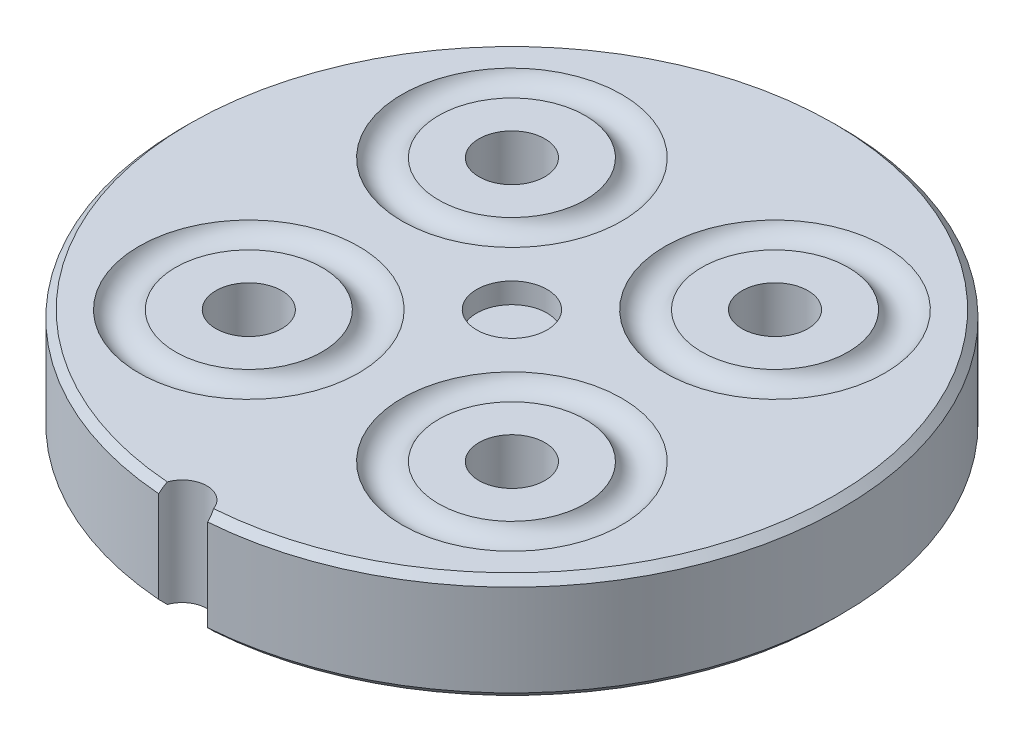
ISO-10303-21;
HEADER;
FILE_DESCRIPTION(('STEP AP214'),'2;1');
FILE_NAME('part.step','',(''),(''),'','','');
FILE_SCHEMA(('AUTOMOTIVE_DESIGN { 1 0 10303 214 1 1 1 1 }'));
ENDSEC;
DATA;
#1=APPLICATION_CONTEXT('core data for automotive mechanical design processes');
#2=APPLICATION_PROTOCOL_DEFINITION('international standard','automotive_design',2000,#1);
#3=PRODUCT_CONTEXT('',#1,'mechanical');
#4=PRODUCT('Part','Part','',(#3));
#5=PRODUCT_RELATED_PRODUCT_CATEGORY('part','',(#4));
#6=PRODUCT_DEFINITION_FORMATION('','',#4);
#7=PRODUCT_DEFINITION_CONTEXT('part definition',#1,'design');
#8=PRODUCT_DEFINITION('design','',#6,#7);
#9=PRODUCT_DEFINITION_SHAPE('','',#8);
#10=(LENGTH_UNIT() NAMED_UNIT(*) SI_UNIT(.MILLI.,.METRE.));
#11=(NAMED_UNIT(*) PLANE_ANGLE_UNIT() SI_UNIT($,.RADIAN.));
#12=(NAMED_UNIT(*) SI_UNIT($,.STERADIAN.) SOLID_ANGLE_UNIT());
#13=UNCERTAINTY_MEASURE_WITH_UNIT(LENGTH_MEASURE(1.E-05),#10,'distance_accuracy_value','');
#14=(GEOMETRIC_REPRESENTATION_CONTEXT(3) GLOBAL_UNCERTAINTY_ASSIGNED_CONTEXT((#13)) GLOBAL_UNIT_ASSIGNED_CONTEXT((#10,
#11,#12)) REPRESENTATION_CONTEXT('',''));
#15=CARTESIAN_POINT('',(0.,0.,0.));
#16=DIRECTION('',(0.,0.,1.));
#17=DIRECTION('',(1.,0.,0.));
#18=AXIS2_PLACEMENT_3D('',#15,#16,#17);
#19=CARTESIAN_POINT('',(0.,0.,11.25));
#20=DIRECTION('',(0.,1.,0.));
#21=DIRECTION('',(0.,0.,1.));
#22=AXIS2_PLACEMENT_3D('',#19,#20,#21);
#23=PLANE('',#22);
#24=CARTESIAN_POINT('',(8.98025612106904,0.,8.98025612106927));
#25=DIRECTION('',(0.,1.,0.));
#26=DIRECTION('',(0.,0.,1.));
#27=AXIS2_PLACEMENT_3D('',#24,#25,#26);
#28=CIRCLE('',#27,7.5);
#29=CARTESIAN_POINT('',(8.98025612106899,0.,16.4802561210693));
#30=VERTEX_POINT('',#29);
#31=EDGE_CURVE('E455',#30,#30,#28,.T.);
#32=ORIENTED_EDGE('',*,*,#31,.T.);
#33=EDGE_LOOP('',(#32));
#34=FACE_BOUND('',#33,.T.);
#35=CARTESIAN_POINT('',(-8.98025612106908,0.,-8.98025612106922));
#36=DIRECTION('',(0.,1.,0.));
#37=DIRECTION('',(0.,0.,-1.));
#38=AXIS2_PLACEMENT_3D('',#35,#36,#37);
#39=CIRCLE('',#38,7.5);
#40=CARTESIAN_POINT('',(-8.98025612106907,0.,-16.4802561210692));
#41=VERTEX_POINT('',#40);
#42=EDGE_CURVE('E223',#41,#41,#39,.T.);
#43=ORIENTED_EDGE('',*,*,#42,.T.);
#44=EDGE_LOOP('',(#43));
#45=FACE_BOUND('',#44,.T.);
#46=CARTESIAN_POINT('',(0.,0.,22.5));
#47=DIRECTION('',(0.,-1.,0.));
#48=DIRECTION('',(0.,0.,1.));
#49=AXIS2_PLACEMENT_3D('',#46,#47,#48);
#50=CIRCLE('',#49,1.67499999999997);
#51=CARTESIAN_POINT('',(-1.57974935984492,0.,21.9432083333333));
#52=VERTEX_POINT('',#51);
#53=CARTESIAN_POINT('',(1.57974935984492,0.,21.9432083333333));
#54=VERTEX_POINT('',#53);
#55=EDGE_CURVE('E124',#52,#54,#50,.T.);
#56=ORIENTED_EDGE('',*,*,#55,.F.);
#57=CARTESIAN_POINT('',(0.,0.,0.));
#58=DIRECTION('',(0.,1.,0.));
#59=DIRECTION('',(0.,0.,1.));
#60=AXIS2_PLACEMENT_3D('',#57,#58,#59);
#61=CIRCLE('',#60,22.);
#62=EDGE_CURVE('E41',#52,#54,#61,.F.);
#63=ORIENTED_EDGE('',*,*,#62,.T.);
#64=EDGE_LOOP('',(#56,#63));
#65=FACE_BOUND('',#64,.T.);
#66=CARTESIAN_POINT('',(-8.9802561210692,0.,8.98025612106911));
#67=DIRECTION('',(0.,1.,0.));
#68=DIRECTION('',(-1.,0.,0.));
#69=AXIS2_PLACEMENT_3D('',#66,#67,#68);
#70=CIRCLE('',#69,7.5);
#71=CARTESIAN_POINT('',(-16.4802561210692,0.,8.98025612106911));
#72=VERTEX_POINT('',#71);
#73=EDGE_CURVE('E235',#72,#72,#70,.T.);
#74=ORIENTED_EDGE('',*,*,#73,.T.);
#75=EDGE_LOOP('',(#74));
#76=FACE_BOUND('',#75,.T.);
#77=CARTESIAN_POINT('',(8.98025612106925,0.,-8.98025612106906));
#78=DIRECTION('',(0.,1.,0.));
#79=DIRECTION('',(1.,0.,0.));
#80=AXIS2_PLACEMENT_3D('',#77,#78,#79);
#81=CIRCLE('',#80,7.5);
#82=CARTESIAN_POINT('',(16.4802561210692,0.,-8.98025612106903));
#83=VERTEX_POINT('',#82);
#84=EDGE_CURVE('E212',#83,#83,#81,.T.);
#85=ORIENTED_EDGE('',*,*,#84,.T.);
#86=EDGE_LOOP('',(#85));
#87=FACE_BOUND('',#86,.T.);
#88=ADVANCED_FACE('F32',(#34,#45,#65,#76,#87),#23,.F.);
#89=CARTESIAN_POINT('',(0.,7.25,11.25));
#90=DIRECTION('',(0.,1.,0.));
#91=DIRECTION('',(0.,0.,1.));
#92=AXIS2_PLACEMENT_3D('',#89,#90,#91);
#93=PLANE('',#92);
#94=CARTESIAN_POINT('',(0.,7.25,0.));
#95=DIRECTION('',(0.,1.,0.));
#96=DIRECTION('',(0.,0.,1.));
#97=AXIS2_PLACEMENT_3D('',#94,#95,#96);
#98=CIRCLE('',#97,2.4);
#99=CARTESIAN_POINT('',(0.,7.25,2.4));
#100=VERTEX_POINT('',#99);
#101=EDGE_CURVE('E452',#100,#100,#98,.T.);
#102=ORIENTED_EDGE('',*,*,#101,.F.);
#103=EDGE_LOOP('',(#102));
#104=FACE_BOUND('',#103,.T.);
#105=CARTESIAN_POINT('',(8.98025612106904,7.25,8.98025612106926));
#106=DIRECTION('',(0.,1.,0.));
#107=DIRECTION('',(0.,0.,1.));
#108=AXIS2_PLACEMENT_3D('',#105,#106,#107);
#109=CIRCLE('',#108,7.5);
#110=CARTESIAN_POINT('',(8.98025612106899,7.25,16.4802561210693));
#111=VERTEX_POINT('',#110);
#112=EDGE_CURVE('E461',#111,#111,#109,.T.);
#113=ORIENTED_EDGE('',*,*,#112,.F.);
#114=EDGE_LOOP('',(#113));
#115=FACE_BOUND('',#114,.T.);
#116=CARTESIAN_POINT('',(-8.98025612106908,7.25,-8.98025612106922));
#117=DIRECTION('',(0.,1.,0.));
#118=DIRECTION('',(0.,0.,-1.));
#119=AXIS2_PLACEMENT_3D('',#116,#117,#118);
#120=CIRCLE('',#119,7.5);
#121=CARTESIAN_POINT('',(-8.98025612106907,7.25,-16.4802561210692));
#122=VERTEX_POINT('',#121);
#123=EDGE_CURVE('E226',#122,#122,#120,.T.);
#124=ORIENTED_EDGE('',*,*,#123,.F.);
#125=EDGE_LOOP('',(#124));
#126=FACE_BOUND('',#125,.T.);
#127=CARTESIAN_POINT('',(0.,7.25,22.5));
#128=DIRECTION('',(0.,-1.,0.));
#129=DIRECTION('',(0.,0.,1.));
#130=AXIS2_PLACEMENT_3D('',#127,#128,#129);
#131=CIRCLE('',#130,1.67499999999997);
#132=CARTESIAN_POINT('',(-1.57974935984494,7.25,21.9432083333334));
#133=VERTEX_POINT('',#132);
#134=CARTESIAN_POINT('',(1.57974935984494,7.25,21.9432083333334));
#135=VERTEX_POINT('',#134);
#136=EDGE_CURVE('E77',#133,#135,#131,.T.);
#137=ORIENTED_EDGE('',*,*,#136,.T.);
#138=CARTESIAN_POINT('',(0.,7.25,0.));
#139=DIRECTION('',(0.,1.,0.));
#140=DIRECTION('',(0.,0.,1.));
#141=AXIS2_PLACEMENT_3D('',#138,#139,#140);
#142=CIRCLE('',#141,22.);
#143=EDGE_CURVE('E11',#135,#133,#142,.T.);
#144=ORIENTED_EDGE('',*,*,#143,.T.);
#145=EDGE_LOOP('',(#137,#144));
#146=FACE_BOUND('',#145,.T.);
#147=CARTESIAN_POINT('',(-8.9802561210692,7.25,8.98025612106911));
#148=DIRECTION('',(0.,1.,0.));
#149=DIRECTION('',(-1.,0.,0.));
#150=AXIS2_PLACEMENT_3D('',#147,#148,#149);
#151=CIRCLE('',#150,7.5);
#152=CARTESIAN_POINT('',(-16.4802561210692,7.25,8.98025612106911));
#153=VERTEX_POINT('',#152);
#154=EDGE_CURVE('E206',#153,#153,#151,.T.);
#155=ORIENTED_EDGE('',*,*,#154,.F.);
#156=EDGE_LOOP('',(#155));
#157=FACE_BOUND('',#156,.T.);
#158=CARTESIAN_POINT('',(8.98025612106924,7.25,-8.98025612106906));
#159=DIRECTION('',(0.,1.,0.));
#160=DIRECTION('',(1.,0.,0.));
#161=AXIS2_PLACEMENT_3D('',#158,#159,#160);
#162=CIRCLE('',#161,7.5);
#163=CARTESIAN_POINT('',(16.4802561210692,7.25,-8.98025612106903));
#164=VERTEX_POINT('',#163);
#165=EDGE_CURVE('E209',#164,#164,#162,.T.);
#166=ORIENTED_EDGE('',*,*,#165,.F.);
#167=EDGE_LOOP('',(#166));
#168=FACE_BOUND('',#167,.T.);
#169=ADVANCED_FACE('F136',(#104,#115,#126,#146,#157,#168),#93,.T.);
#170=CARTESIAN_POINT('',(8.98025612106904,0.,8.98025612106927));
#171=DIRECTION('',(0.,1.,0.));
#172=DIRECTION('',(0.,0.,1.));
#173=AXIS2_PLACEMENT_3D('',#170,#171,#172);
#174=CIRCLE('',#173,4.99242800861692);
#175=CARTESIAN_POINT('',(8.98025612106901,0.,13.9726841296862));
#176=VERTEX_POINT('',#175);
#177=EDGE_CURVE('E451',#176,#176,#174,.T.);
#178=ORIENTED_EDGE('',*,*,#177,.F.);
#179=EDGE_LOOP('',(#178));
#180=FACE_BOUND('',#179,.T.);
#181=CARTESIAN_POINT('',(8.98025612106914,0.,8.98025612106917));
#182=DIRECTION('',(0.,1.,0.));
#183=DIRECTION('',(0.,0.,1.));
#184=AXIS2_PLACEMENT_3D('',#181,#182,#183);
#185=CIRCLE('',#184,2.25);
#186=CARTESIAN_POINT('',(8.98025612106914,0.,11.2302561210692));
#187=VERTEX_POINT('',#186);
#188=EDGE_CURVE('E193',#187,#187,#185,.T.);
#189=ORIENTED_EDGE('',*,*,#188,.T.);
#190=EDGE_LOOP('',(#189));
#191=FACE_BOUND('',#190,.T.);
#192=ADVANCED_FACE('F138',(#180,#191),#23,.F.);
#193=CARTESIAN_POINT('',(8.98025612106904,7.25,8.98025612106926));
#194=DIRECTION('',(0.,1.,0.));
#195=DIRECTION('',(0.,0.,1.));
#196=AXIS2_PLACEMENT_3D('',#193,#194,#195);
#197=CIRCLE('',#196,5.);
#198=CARTESIAN_POINT('',(8.98025612106901,7.25,13.9802561210693));
#199=VERTEX_POINT('',#198);
#200=EDGE_CURVE('E464',#199,#199,#197,.T.);
#201=ORIENTED_EDGE('',*,*,#200,.T.);
#202=EDGE_LOOP('',(#201));
#203=FACE_BOUND('',#202,.T.);
#204=CARTESIAN_POINT('',(8.98025612106914,7.25,8.98025612106917));
#205=DIRECTION('',(0.,1.,0.));
#206=DIRECTION('',(0.,0.,1.));
#207=AXIS2_PLACEMENT_3D('',#204,#205,#206);
#208=CIRCLE('',#207,2.25);
#209=CARTESIAN_POINT('',(8.98025612106914,7.25,11.2302561210692));
#210=VERTEX_POINT('',#209);
#211=EDGE_CURVE('E187',#210,#210,#208,.F.);
#212=ORIENTED_EDGE('',*,*,#211,.T.);
#213=EDGE_LOOP('',(#212));
#214=FACE_BOUND('',#213,.T.);
#215=ADVANCED_FACE('F144',(#203,#214),#93,.T.);
#216=CARTESIAN_POINT('',(8.98025612106925,0.,-8.98025612106906));
#217=DIRECTION('',(0.,1.,0.));
#218=DIRECTION('',(1.,0.,0.));
#219=AXIS2_PLACEMENT_3D('',#216,#217,#218);
#220=CIRCLE('',#219,4.99242800861692);
#221=CARTESIAN_POINT('',(13.9726841296862,0.,-8.98025612106904));
#222=VERTEX_POINT('',#221);
#223=EDGE_CURVE('E181',#222,#222,#220,.T.);
#224=ORIENTED_EDGE('',*,*,#223,.F.);
#225=EDGE_LOOP('',(#224));
#226=FACE_BOUND('',#225,.T.);
#227=CARTESIAN_POINT('',(8.9802561210692,0.,-8.98025612106911));
#228=DIRECTION('',(0.,1.,0.));
#229=DIRECTION('',(0.,0.,1.));
#230=AXIS2_PLACEMENT_3D('',#227,#228,#229);
#231=CIRCLE('',#230,2.25);
#232=CARTESIAN_POINT('',(8.9802561210692,0.,-6.7302561210691));
#233=VERTEX_POINT('',#232);
#234=EDGE_CURVE('E184',#233,#233,#231,.T.);
#235=ORIENTED_EDGE('',*,*,#234,.T.);
#236=EDGE_LOOP('',(#235));
#237=FACE_BOUND('',#236,.T.);
#238=ADVANCED_FACE('F150',(#226,#237),#23,.F.);
#239=CARTESIAN_POINT('',(8.98025612106924,7.25,-8.98025612106906));
#240=DIRECTION('',(0.,1.,0.));
#241=DIRECTION('',(1.,0.,0.));
#242=AXIS2_PLACEMENT_3D('',#239,#240,#241);
#243=CIRCLE('',#242,5.);
#244=CARTESIAN_POINT('',(13.9802561210692,7.25,-8.98025612106904));
#245=VERTEX_POINT('',#244);
#246=EDGE_CURVE('E211',#245,#245,#243,.T.);
#247=ORIENTED_EDGE('',*,*,#246,.T.);
#248=EDGE_LOOP('',(#247));
#249=FACE_BOUND('',#248,.T.);
#250=CARTESIAN_POINT('',(8.9802561210692,7.25,-8.98025612106911));
#251=DIRECTION('',(0.,1.,0.));
#252=DIRECTION('',(0.,0.,1.));
#253=AXIS2_PLACEMENT_3D('',#250,#251,#252);
#254=CIRCLE('',#253,2.25);
#255=CARTESIAN_POINT('',(8.9802561210692,7.25,-6.7302561210691));
#256=VERTEX_POINT('',#255);
#257=EDGE_CURVE('E186',#256,#256,#254,.F.);
#258=ORIENTED_EDGE('',*,*,#257,.T.);
#259=EDGE_LOOP('',(#258));
#260=FACE_BOUND('',#259,.T.);
#261=ADVANCED_FACE('F162',(#249,#260),#93,.T.);
#262=CARTESIAN_POINT('',(-8.98025612106908,0.,-8.98025612106922));
#263=DIRECTION('',(0.,1.,0.));
#264=DIRECTION('',(0.,0.,-1.));
#265=AXIS2_PLACEMENT_3D('',#262,#263,#264);
#266=CIRCLE('',#265,4.99242800861692);
#267=CARTESIAN_POINT('',(-8.98025612106907,0.,-13.9726841296861));
#268=VERTEX_POINT('',#267);
#269=EDGE_CURVE('E215',#268,#268,#266,.T.);
#270=ORIENTED_EDGE('',*,*,#269,.F.);
#271=EDGE_LOOP('',(#270));
#272=FACE_BOUND('',#271,.T.);
#273=CARTESIAN_POINT('',(-8.98025612106914,0.,-8.98025612106917));
#274=DIRECTION('',(0.,1.,0.));
#275=DIRECTION('',(0.,0.,1.));
#276=AXIS2_PLACEMENT_3D('',#273,#274,#275);
#277=CIRCLE('',#276,2.25);
#278=CARTESIAN_POINT('',(-8.98025612106914,0.,-6.73025612106917));
#279=VERTEX_POINT('',#278);
#280=EDGE_CURVE('E190',#279,#279,#277,.T.);
#281=ORIENTED_EDGE('',*,*,#280,.T.);
#282=EDGE_LOOP('',(#281));
#283=FACE_BOUND('',#282,.T.);
#284=ADVANCED_FACE('F153',(#272,#283),#23,.F.);
#285=CARTESIAN_POINT('',(-8.98025612106908,7.25,-8.98025612106922));
#286=DIRECTION('',(0.,1.,0.));
#287=DIRECTION('',(0.,0.,-1.));
#288=AXIS2_PLACEMENT_3D('',#285,#286,#287);
#289=CIRCLE('',#288,5.);
#290=CARTESIAN_POINT('',(-8.98025612106907,7.25,-13.9802561210692));
#291=VERTEX_POINT('',#290);
#292=EDGE_CURVE('E229',#291,#291,#289,.T.);
#293=ORIENTED_EDGE('',*,*,#292,.T.);
#294=EDGE_LOOP('',(#293));
#295=FACE_BOUND('',#294,.T.);
#296=CARTESIAN_POINT('',(-8.98025612106914,7.25,-8.98025612106917));
#297=DIRECTION('',(0.,1.,0.));
#298=DIRECTION('',(0.,0.,1.));
#299=AXIS2_PLACEMENT_3D('',#296,#297,#298);
#300=CIRCLE('',#299,2.25);
#301=CARTESIAN_POINT('',(-8.98025612106914,7.25,-6.73025612106917));
#302=VERTEX_POINT('',#301);
#303=EDGE_CURVE('E127',#302,#302,#300,.F.);
#304=ORIENTED_EDGE('',*,*,#303,.T.);
#305=EDGE_LOOP('',(#304));
#306=FACE_BOUND('',#305,.T.);
#307=ADVANCED_FACE('F157',(#295,#306),#93,.T.);
#308=CARTESIAN_POINT('',(-8.9802561210692,7.25,8.98025612106911));
#309=DIRECTION('',(0.,1.,0.));
#310=DIRECTION('',(-1.,0.,0.));
#311=AXIS2_PLACEMENT_3D('',#308,#309,#310);
#312=CIRCLE('',#311,5.);
#313=CARTESIAN_POINT('',(-13.9802561210692,7.25,8.98025612106911));
#314=VERTEX_POINT('',#313);
#315=EDGE_CURVE('E239',#314,#314,#312,.T.);
#316=ORIENTED_EDGE('',*,*,#315,.T.);
#317=EDGE_LOOP('',(#316));
#318=FACE_BOUND('',#317,.T.);
#319=CARTESIAN_POINT('',(-8.9802561210692,7.25,8.98025612106911));
#320=DIRECTION('',(0.,1.,0.));
#321=DIRECTION('',(0.,0.,1.));
#322=AXIS2_PLACEMENT_3D('',#319,#320,#321);
#323=CIRCLE('',#322,2.25);
#324=CARTESIAN_POINT('',(-8.9802561210692,7.25,11.2302561210691));
#325=VERTEX_POINT('',#324);
#326=EDGE_CURVE('E245',#325,#325,#323,.F.);
#327=ORIENTED_EDGE('',*,*,#326,.T.);
#328=EDGE_LOOP('',(#327));
#329=FACE_BOUND('',#328,.T.);
#330=ADVANCED_FACE('F145',(#318,#329),#93,.T.);
#331=CARTESIAN_POINT('',(-8.9802561210692,0.,8.98025612106911));
#332=DIRECTION('',(0.,1.,0.));
#333=DIRECTION('',(-1.,0.,0.));
#334=AXIS2_PLACEMENT_3D('',#331,#332,#333);
#335=CIRCLE('',#334,4.99242800861692);
#336=CARTESIAN_POINT('',(-13.9726841296861,0.,8.98025612106911));
#337=VERTEX_POINT('',#336);
#338=EDGE_CURVE('E232',#337,#337,#335,.T.);
#339=ORIENTED_EDGE('',*,*,#338,.F.);
#340=EDGE_LOOP('',(#339));
#341=FACE_BOUND('',#340,.T.);
#342=CARTESIAN_POINT('',(-8.9802561210692,0.,8.98025612106911));
#343=DIRECTION('',(0.,1.,0.));
#344=DIRECTION('',(0.,0.,1.));
#345=AXIS2_PLACEMENT_3D('',#342,#343,#344);
#346=CIRCLE('',#345,2.25);
#347=CARTESIAN_POINT('',(-8.9802561210692,0.,11.2302561210691));
#348=VERTEX_POINT('',#347);
#349=EDGE_CURVE('E242',#348,#348,#346,.T.);
#350=ORIENTED_EDGE('',*,*,#349,.T.);
#351=EDGE_LOOP('',(#350));
#352=FACE_BOUND('',#351,.T.);
#353=ADVANCED_FACE('F104',(#341,#352),#23,.F.);
#354=CARTESIAN_POINT('',(0.,7.25,22.5));
#355=DIRECTION('',(0.,-1.,0.));
#356=DIRECTION('',(0.,0.,-1.));
#357=AXIS2_PLACEMENT_3D('',#354,#355,#356);
#358=CYLINDRICAL_SURFACE('',#357,1.67499999999997);
#359=DIRECTION('',(0.,-1.,0.));
#360=VECTOR('',#359,1.);
#361=CARTESIAN_POINT('',(-1.67383924672625,7.25,22.4376527777778));
#362=LINE('',#361,#360);
#363=CARTESIAN_POINT('',(-1.67383924672625,6.75000000000002,22.4376527777778));
#364=VERTEX_POINT('',#363);
#365=CARTESIAN_POINT('',(-1.67383924672625,0.500000000000014,22.4376527777778));
#366=VERTEX_POINT('',#365);
#367=EDGE_CURVE('E76',#364,#366,#362,.T.);
#368=ORIENTED_EDGE('',*,*,#367,.T.);
#369=CARTESIAN_POINT('',(-1.67383924672625,0.500000000000014,22.4376527777778));
#370=CARTESIAN_POINT('',(-1.67227439676891,0.458069445163777,22.3957217814153));
#371=CARTESIAN_POINT('',(-1.66914102440047,0.416108696742878,22.3538786900626));
#372=CARTESIAN_POINT('',(-1.65974598469672,0.332368127680124,22.2706066218276));
#373=CARTESIAN_POINT('',(-1.65349334454531,0.290588133845584,22.2291767998156));
#374=CARTESIAN_POINT('',(-1.63785939504558,0.20720691667142,22.1467261374928));
#375=CARTESIAN_POINT('',(-1.62847802656123,0.165605696725853,22.1057053049275));
#376=CARTESIAN_POINT('',(-1.6065223902502,0.08259477978534,22.0240807549616));
#377=CARTESIAN_POINT('',(-1.59393898637444,0.0411859819503708,21.9834785829094));
#378=CARTESIAN_POINT('',(-1.57974935984492,0.,21.9432083333333));
#379=B_SPLINE_CURVE_WITH_KNOTS('',3,(#369,#370,#371,#372,#373,#374,#375,#376,#377,#378),
.UNSPECIFIED.,.F.,.F.,(4,2,2,2,4),(0.,0.177939060279375,0.355366125186567,0.532796543828657,
0.710738997204632),.UNSPECIFIED.);
#380=EDGE_CURVE('E115',#366,#52,#379,.T.);
#381=ORIENTED_EDGE('',*,*,#380,.T.);
#382=ORIENTED_EDGE('',*,*,#55,.T.);
#383=CARTESIAN_POINT('',(1.57974935984492,0.,21.9432083333333));
#384=CARTESIAN_POINT('',(1.59393898637444,0.0411859819503697,21.9834785829094));
#385=CARTESIAN_POINT('',(1.6065223902502,0.0825947797853378,22.0240807549616));
#386=CARTESIAN_POINT('',(1.62847802656123,0.165605696725851,22.1057053049275));
#387=CARTESIAN_POINT('',(1.63785939504558,0.207206916671419,22.1467261374928));
#388=CARTESIAN_POINT('',(1.65349334454531,0.290588133845584,22.2291767998156));
#389=CARTESIAN_POINT('',(1.65974598469672,0.332368127680123,22.2706066218276));
#390=CARTESIAN_POINT('',(1.66914102440047,0.416108696742878,22.3538786900626));
#391=CARTESIAN_POINT('',(1.6722743967689,0.458069445163777,22.3957217814153));
#392=CARTESIAN_POINT('',(1.67383924672624,0.500000000000014,22.4376527777778));
#393=B_SPLINE_CURVE_WITH_KNOTS('',3,(#383,#384,#385,#386,#387,#388,#389,#390,#391,#392),
.UNSPECIFIED.,.F.,.F.,(4,2,2,2,4),(0.,0.17794245337597,0.355372872018065,0.532799936925257,
0.710738997204631),.UNSPECIFIED.);
#394=CARTESIAN_POINT('',(1.67383924672624,0.500000000000014,22.4376527777778));
#395=VERTEX_POINT('',#394);
#396=EDGE_CURVE('E78',#54,#395,#393,.T.);
#397=ORIENTED_EDGE('',*,*,#396,.T.);
#398=DIRECTION('',(0.,-1.,0.));
#399=VECTOR('',#398,1.);
#400=CARTESIAN_POINT('',(1.67383924672624,7.25,22.4376527777778));
#401=LINE('',#400,#399);
#402=CARTESIAN_POINT('',(1.67383924672624,6.75000000000002,22.4376527777778));
#403=VERTEX_POINT('',#402);
#404=EDGE_CURVE('E87',#403,#395,#401,.T.);
#405=ORIENTED_EDGE('',*,*,#404,.F.);
#406=CARTESIAN_POINT('',(1.67383924672624,6.75000000000002,22.4376527777778));
#407=CARTESIAN_POINT('',(1.6722743967689,6.79193055483625,22.3957217814153));
#408=CARTESIAN_POINT('',(1.66914102440047,6.83389130325715,22.3538786900626));
#409=CARTESIAN_POINT('',(1.65974598469672,6.9176318723199,22.2706066218276));
#410=CARTESIAN_POINT('',(1.65349334454531,6.95941186615443,22.2291767998156));
#411=CARTESIAN_POINT('',(1.63785939504558,7.04279308332859,22.1467261374929));
#412=CARTESIAN_POINT('',(1.62847802656124,7.08439430327416,22.1057053049275));
#413=CARTESIAN_POINT('',(1.60652239025021,7.16740522021467,22.0240807549617));
#414=CARTESIAN_POINT('',(1.59393898637445,7.20881401804963,21.9834785829094));
#415=CARTESIAN_POINT('',(1.57974935984494,7.25,21.9432083333334));
#416=B_SPLINE_CURVE_WITH_KNOTS('',3,(#406,#407,#408,#409,#410,#411,#412,#413,#414,#415),
.UNSPECIFIED.,.F.,.F.,(4,2,2,2,4),(0.,0.177939060279359,0.355366125186537,0.532796543828616,
0.710738997204573),.UNSPECIFIED.);
#417=EDGE_CURVE('E48',#403,#135,#416,.T.);
#418=ORIENTED_EDGE('',*,*,#417,.T.);
#419=ORIENTED_EDGE('',*,*,#136,.F.);
#420=CARTESIAN_POINT('',(-1.57974935984493,7.25,21.9432083333334));
#421=CARTESIAN_POINT('',(-1.59393898637445,7.20881401804963,21.9834785829094));
#422=CARTESIAN_POINT('',(-1.60652239025021,7.16740522021467,22.0240807549617));
#423=CARTESIAN_POINT('',(-1.62847802656124,7.08439430327416,22.1057053049275));
#424=CARTESIAN_POINT('',(-1.63785939504558,7.04279308332859,22.1467261374929));
#425=CARTESIAN_POINT('',(-1.65349334454531,6.95941186615443,22.2291767998156));
#426=CARTESIAN_POINT('',(-1.65974598469672,6.9176318723199,22.2706066218276));
#427=CARTESIAN_POINT('',(-1.66914102440047,6.83389130325715,22.3538786900626));
#428=CARTESIAN_POINT('',(-1.6722743967689,6.79193055483625,22.3957217814153));
#429=CARTESIAN_POINT('',(-1.67383924672624,6.75000000000002,22.4376527777778));
#430=B_SPLINE_CURVE_WITH_KNOTS('',3,(#420,#421,#422,#423,#424,#425,#426,#427,#428,#429),
.UNSPECIFIED.,.F.,.F.,(4,2,2,2,4),(0.,0.177942453375959,0.355372872018037,0.532799936925218,
0.710738997204576),.UNSPECIFIED.);
#431=EDGE_CURVE('E56',#133,#364,#430,.T.);
#432=ORIENTED_EDGE('',*,*,#431,.T.);
#433=EDGE_LOOP('',(#368,#381,#382,#397,#405,#418,#419,#432));
#434=FACE_BOUND('',#433,.T.);
#435=ADVANCED_FACE('F75',(#434),#358,.F.);
#436=CARTESIAN_POINT('',(0.,7.25,0.));
#437=DIRECTION('',(0.,-1.,0.));
#438=DIRECTION('',(0.,0.,-1.));
#439=AXIS2_PLACEMENT_3D('',#436,#437,#438);
#440=CYLINDRICAL_SURFACE('',#439,22.5);
#441=ORIENTED_EDGE('',*,*,#404,.T.);
#442=CARTESIAN_POINT('',(0.,0.500000000000014,0.));
#443=DIRECTION('',(0.,1.,0.));
#444=DIRECTION('',(0.,0.,1.));
#445=AXIS2_PLACEMENT_3D('',#442,#443,#444);
#446=CIRCLE('',#445,22.5);
#447=EDGE_CURVE('E86',#395,#366,#446,.T.);
#448=ORIENTED_EDGE('',*,*,#447,.T.);
#449=ORIENTED_EDGE('',*,*,#367,.F.);
#450=CARTESIAN_POINT('',(0.,6.75000000000002,0.));
#451=DIRECTION('',(0.,1.,0.));
#452=DIRECTION('',(0.,0.,1.));
#453=AXIS2_PLACEMENT_3D('',#450,#451,#452);
#454=CIRCLE('',#453,22.5);
#455=EDGE_CURVE('E84',#364,#403,#454,.F.);
#456=ORIENTED_EDGE('',*,*,#455,.T.);
#457=EDGE_LOOP('',(#441,#448,#449,#456));
#458=FACE_BOUND('',#457,.T.);
#459=ADVANCED_FACE('F83',(#458),#440,.T.);
#460=CARTESIAN_POINT('',(0.,0.500000000000014,0.));
#461=DIRECTION('',(0.,1.,0.));
#462=DIRECTION('',(0.,0.,1.));
#463=AXIS2_PLACEMENT_3D('',#460,#461,#462);
#464=CONICAL_SURFACE('',#463,22.5,0.785398163397452);
#465=ORIENTED_EDGE('',*,*,#396,.F.);
#466=ORIENTED_EDGE('',*,*,#62,.F.);
#467=ORIENTED_EDGE('',*,*,#380,.F.);
#468=ORIENTED_EDGE('',*,*,#447,.F.);
#469=EDGE_LOOP('',(#465,#466,#467,#468));
#470=FACE_BOUND('',#469,.T.);
#471=ADVANCED_FACE('F106',(#470),#464,.T.);
#472=CARTESIAN_POINT('',(0.,7.25,0.));
#473=DIRECTION('',(0.,-1.,0.));
#474=DIRECTION('',(0.,0.,-1.));
#475=AXIS2_PLACEMENT_3D('',#472,#473,#474);
#476=CONICAL_SURFACE('',#475,22.,0.785398163397441);
#477=ORIENTED_EDGE('',*,*,#417,.F.);
#478=ORIENTED_EDGE('',*,*,#455,.F.);
#479=ORIENTED_EDGE('',*,*,#431,.F.);
#480=ORIENTED_EDGE('',*,*,#143,.F.);
#481=EDGE_LOOP('',(#477,#478,#479,#480));
#482=FACE_BOUND('',#481,.T.);
#483=ADVANCED_FACE('F34',(#482),#476,.T.);
#484=CARTESIAN_POINT('',(-8.98025612106914,10.,-8.98025612106917));
#485=DIRECTION('',(0.,-1.,0.));
#486=DIRECTION('',(0.,0.,-1.));
#487=AXIS2_PLACEMENT_3D('',#484,#485,#486);
#488=CYLINDRICAL_SURFACE('',#487,2.25);
#489=ORIENTED_EDGE('',*,*,#303,.F.);
#490=EDGE_LOOP('',(#489));
#491=FACE_BOUND('',#490,.T.);
#492=ORIENTED_EDGE('',*,*,#280,.F.);
#493=EDGE_LOOP('',(#492));
#494=FACE_BOUND('',#493,.T.);
#495=ADVANCED_FACE('F134',(#491,#494),#488,.F.);
#496=CARTESIAN_POINT('',(8.9802561210692,10.,-8.98025612106911));
#497=DIRECTION('',(0.,-1.,0.));
#498=DIRECTION('',(0.,0.,-1.));
#499=AXIS2_PLACEMENT_3D('',#496,#497,#498);
#500=CYLINDRICAL_SURFACE('',#499,2.25);
#501=ORIENTED_EDGE('',*,*,#257,.F.);
#502=EDGE_LOOP('',(#501));
#503=FACE_BOUND('',#502,.T.);
#504=ORIENTED_EDGE('',*,*,#234,.F.);
#505=EDGE_LOOP('',(#504));
#506=FACE_BOUND('',#505,.T.);
#507=ADVANCED_FACE('F254',(#503,#506),#500,.F.);
#508=CARTESIAN_POINT('',(8.98025612106914,10.,8.98025612106917));
#509=DIRECTION('',(0.,-1.,0.));
#510=DIRECTION('',(0.,0.,-1.));
#511=AXIS2_PLACEMENT_3D('',#508,#509,#510);
#512=CYLINDRICAL_SURFACE('',#511,2.25);
#513=ORIENTED_EDGE('',*,*,#211,.F.);
#514=EDGE_LOOP('',(#513));
#515=FACE_BOUND('',#514,.T.);
#516=ORIENTED_EDGE('',*,*,#188,.F.);
#517=EDGE_LOOP('',(#516));
#518=FACE_BOUND('',#517,.T.);
#519=ADVANCED_FACE('F251',(#515,#518),#512,.F.);
#520=CARTESIAN_POINT('',(-8.9802561210692,10.,8.98025612106911));
#521=DIRECTION('',(0.,-1.,0.));
#522=DIRECTION('',(0.,0.,-1.));
#523=AXIS2_PLACEMENT_3D('',#520,#521,#522);
#524=CYLINDRICAL_SURFACE('',#523,2.25);
#525=ORIENTED_EDGE('',*,*,#326,.F.);
#526=EDGE_LOOP('',(#525));
#527=FACE_BOUND('',#526,.T.);
#528=ORIENTED_EDGE('',*,*,#349,.F.);
#529=EDGE_LOOP('',(#528));
#530=FACE_BOUND('',#529,.T.);
#531=ADVANCED_FACE('F253',(#527,#530),#524,.F.);
#532=CARTESIAN_POINT('',(-8.9802561210692,7.8,8.98025612106911));
#533=DIRECTION('',(0.,1.,0.));
#534=DIRECTION('',(-1.,0.,0.));
#535=AXIS2_PLACEMENT_3D('',#532,#533,#534);
#536=TOROIDAL_SURFACE('',#535,6.25,1.36565002837477);
#537=ORIENTED_EDGE('',*,*,#315,.F.);
#538=EDGE_LOOP('',(#537));
#539=FACE_BOUND('',#538,.T.);
#540=ORIENTED_EDGE('',*,*,#154,.T.);
#541=EDGE_LOOP('',(#540));
#542=FACE_BOUND('',#541,.T.);
#543=ADVANCED_FACE('F261',(#539,#542),#536,.F.);
#544=CARTESIAN_POINT('',(-8.9802561210692,-0.541313843355008,8.98025612106911));
#545=DIRECTION('',(0.,1.,0.));
#546=DIRECTION('',(-1.,0.,0.));
#547=AXIS2_PLACEMENT_3D('',#544,#545,#546);
#548=TOROIDAL_SURFACE('',#547,6.24621400430846,1.36565002837477);
#549=ORIENTED_EDGE('',*,*,#73,.F.);
#550=EDGE_LOOP('',(#549));
#551=FACE_BOUND('',#550,.T.);
#552=ORIENTED_EDGE('',*,*,#338,.T.);
#553=EDGE_LOOP('',(#552));
#554=FACE_BOUND('',#553,.T.);
#555=ADVANCED_FACE('F314',(#551,#554),#548,.F.);
#556=CARTESIAN_POINT('',(-8.98025612106908,7.8,-8.98025612106922));
#557=DIRECTION('',(0.,1.,0.));
#558=DIRECTION('',(0.,0.,-1.));
#559=AXIS2_PLACEMENT_3D('',#556,#557,#558);
#560=TOROIDAL_SURFACE('',#559,6.25,1.36565002837477);
#561=ORIENTED_EDGE('',*,*,#292,.F.);
#562=EDGE_LOOP('',(#561));
#563=FACE_BOUND('',#562,.T.);
#564=ORIENTED_EDGE('',*,*,#123,.T.);
#565=EDGE_LOOP('',(#564));
#566=FACE_BOUND('',#565,.T.);
#567=ADVANCED_FACE('F323',(#563,#566),#560,.F.);
#568=CARTESIAN_POINT('',(-8.98025612106908,-0.541313843355008,-8.98025612106922));
#569=DIRECTION('',(0.,1.,0.));
#570=DIRECTION('',(0.,0.,-1.));
#571=AXIS2_PLACEMENT_3D('',#568,#569,#570);
#572=TOROIDAL_SURFACE('',#571,6.24621400430846,1.36565002837477);
#573=ORIENTED_EDGE('',*,*,#42,.F.);
#574=EDGE_LOOP('',(#573));
#575=FACE_BOUND('',#574,.T.);
#576=ORIENTED_EDGE('',*,*,#269,.T.);
#577=EDGE_LOOP('',(#576));
#578=FACE_BOUND('',#577,.T.);
#579=ADVANCED_FACE('F369',(#575,#578),#572,.F.);
#580=CARTESIAN_POINT('',(8.98025612106924,7.8,-8.98025612106906));
#581=DIRECTION('',(0.,1.,0.));
#582=DIRECTION('',(1.,0.,0.));
#583=AXIS2_PLACEMENT_3D('',#580,#581,#582);
#584=TOROIDAL_SURFACE('',#583,6.25,1.36565002837477);
#585=ORIENTED_EDGE('',*,*,#246,.F.);
#586=EDGE_LOOP('',(#585));
#587=FACE_BOUND('',#586,.T.);
#588=ORIENTED_EDGE('',*,*,#165,.T.);
#589=EDGE_LOOP('',(#588));
#590=FACE_BOUND('',#589,.T.);
#591=ADVANCED_FACE('F379',(#587,#590),#584,.F.);
#592=CARTESIAN_POINT('',(8.98025612106925,-0.541313843355008,-8.98025612106906));
#593=DIRECTION('',(0.,1.,0.));
#594=DIRECTION('',(1.,0.,0.));
#595=AXIS2_PLACEMENT_3D('',#592,#593,#594);
#596=TOROIDAL_SURFACE('',#595,6.24621400430846,1.36565002837477);
#597=ORIENTED_EDGE('',*,*,#84,.F.);
#598=EDGE_LOOP('',(#597));
#599=FACE_BOUND('',#598,.T.);
#600=ORIENTED_EDGE('',*,*,#223,.T.);
#601=EDGE_LOOP('',(#600));
#602=FACE_BOUND('',#601,.T.);
#603=ADVANCED_FACE('F389',(#599,#602),#596,.F.);
#604=CARTESIAN_POINT('',(8.98025612106904,7.8,8.98025612106926));
#605=DIRECTION('',(0.,1.,0.));
#606=DIRECTION('',(0.,0.,1.));
#607=AXIS2_PLACEMENT_3D('',#604,#605,#606);
#608=TOROIDAL_SURFACE('',#607,6.25,1.36565002837477);
#609=ORIENTED_EDGE('',*,*,#200,.F.);
#610=EDGE_LOOP('',(#609));
#611=FACE_BOUND('',#610,.T.);
#612=ORIENTED_EDGE('',*,*,#112,.T.);
#613=EDGE_LOOP('',(#612));
#614=FACE_BOUND('',#613,.T.);
#615=ADVANCED_FACE('F399',(#611,#614),#608,.F.);
#616=CARTESIAN_POINT('',(8.98025612106904,-0.541313843355008,8.98025612106927));
#617=DIRECTION('',(0.,1.,0.));
#618=DIRECTION('',(0.,0.,1.));
#619=AXIS2_PLACEMENT_3D('',#616,#617,#618);
#620=TOROIDAL_SURFACE('',#619,6.24621400430846,1.36565002837477);
#621=ORIENTED_EDGE('',*,*,#31,.F.);
#622=EDGE_LOOP('',(#621));
#623=FACE_BOUND('',#622,.T.);
#624=ORIENTED_EDGE('',*,*,#177,.T.);
#625=EDGE_LOOP('',(#624));
#626=FACE_BOUND('',#625,.T.);
#627=ADVANCED_FACE('F409',(#623,#626),#620,.F.);
#628=CARTESIAN_POINT('',(0.,5.85,0.));
#629=DIRECTION('',(0.,1.,0.));
#630=DIRECTION('',(0.,0.,1.));
#631=AXIS2_PLACEMENT_3D('',#628,#629,#630);
#632=CYLINDRICAL_SURFACE('',#631,2.4);
#633=CARTESIAN_POINT('',(0.,5.85,0.));
#634=DIRECTION('',(0.,1.,0.));
#635=DIRECTION('',(0.,0.,1.));
#636=AXIS2_PLACEMENT_3D('',#633,#634,#635);
#637=CIRCLE('',#636,2.4);
#638=CARTESIAN_POINT('',(0.,5.85,2.4));
#639=VERTEX_POINT('',#638);
#640=EDGE_CURVE('E450',#639,#639,#637,.T.);
#641=ORIENTED_EDGE('',*,*,#640,.F.);
#642=EDGE_LOOP('',(#641));
#643=FACE_BOUND('',#642,.T.);
#644=ORIENTED_EDGE('',*,*,#101,.T.);
#645=EDGE_LOOP('',(#644));
#646=FACE_BOUND('',#645,.T.);
#647=ADVANCED_FACE('F419',(#643,#646),#632,.F.);
#648=CARTESIAN_POINT('',(0.,5.85,0.));
#649=DIRECTION('',(0.,1.,0.));
#650=DIRECTION('',(0.,0.,1.));
#651=AXIS2_PLACEMENT_3D('',#648,#649,#650);
#652=PLANE('',#651);
#653=ORIENTED_EDGE('',*,*,#640,.T.);
#654=EDGE_LOOP('',(#653));
#655=FACE_BOUND('',#654,.T.);
#656=ADVANCED_FACE('F434',(#655),#652,.T.);
#657=CLOSED_SHELL('',(#88,#169,#192,#215,#238,#261,#284,#307,#330,#353,#435,#459,#471,#483,#495,
#507,#519,#531,#543,#555,#567,#579,#591,#603,#615,#627,#647,#656));
#658=MANIFOLD_SOLID_BREP('B2',#657);
#659=ADVANCED_BREP_SHAPE_REPRESENTATION('',(#18,#658),#14);
#660=SHAPE_DEFINITION_REPRESENTATION(#9,#659);
ENDSEC;
END-ISO-10303-21;
